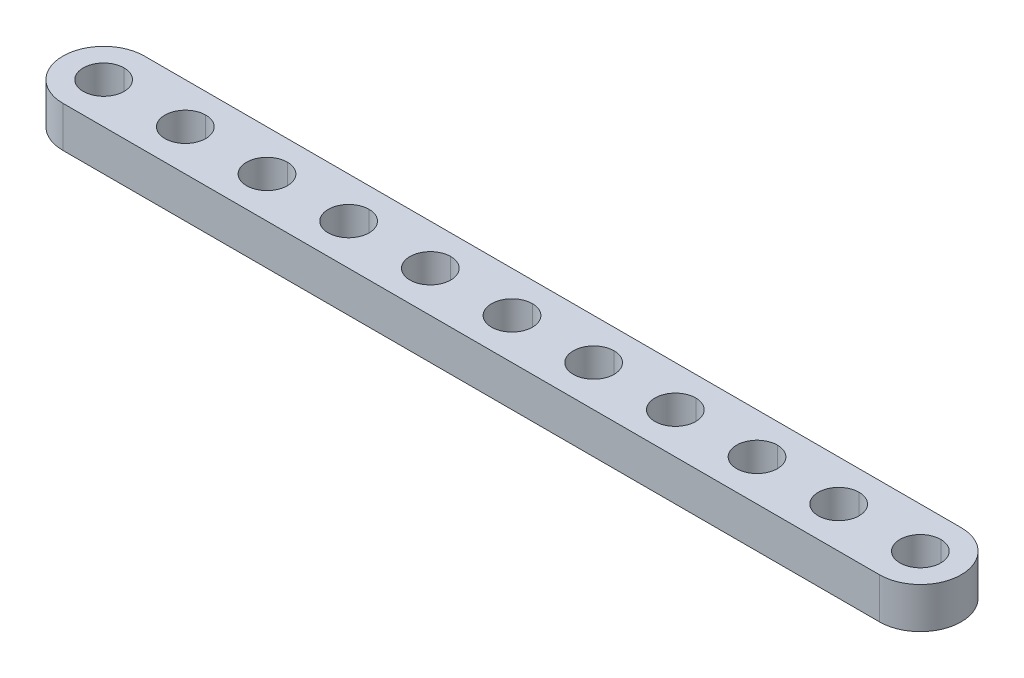
ISO-10303-21;
HEADER;
FILE_DESCRIPTION(('STEP AP214'),'2;1');
FILE_NAME('part.step','',(''),(''),'','','');
FILE_SCHEMA(('AUTOMOTIVE_DESIGN { 1 0 10303 214 1 1 1 1 }'));
ENDSEC;
DATA;
#1=APPLICATION_CONTEXT('core data for automotive mechanical design processes');
#2=APPLICATION_PROTOCOL_DEFINITION('international standard','automotive_design',2000,#1);
#3=PRODUCT_CONTEXT('',#1,'mechanical');
#4=PRODUCT('Part','Part','',(#3));
#5=PRODUCT_RELATED_PRODUCT_CATEGORY('part','',(#4));
#6=PRODUCT_DEFINITION_FORMATION('','',#4);
#7=PRODUCT_DEFINITION_CONTEXT('part definition',#1,'design');
#8=PRODUCT_DEFINITION('design','',#6,#7);
#9=PRODUCT_DEFINITION_SHAPE('','',#8);
#10=(LENGTH_UNIT() NAMED_UNIT(*) SI_UNIT(.MILLI.,.METRE.));
#11=(NAMED_UNIT(*) PLANE_ANGLE_UNIT() SI_UNIT($,.RADIAN.));
#12=(NAMED_UNIT(*) SI_UNIT($,.STERADIAN.) SOLID_ANGLE_UNIT());
#13=UNCERTAINTY_MEASURE_WITH_UNIT(LENGTH_MEASURE(1.E-05),#10,'distance_accuracy_value','');
#14=(GEOMETRIC_REPRESENTATION_CONTEXT(3) GLOBAL_UNCERTAINTY_ASSIGNED_CONTEXT((#13)) GLOBAL_UNIT_ASSIGNED_CONTEXT((#10,
#11,#12)) REPRESENTATION_CONTEXT('',''));
#15=CARTESIAN_POINT('',(0.,0.,0.));
#16=DIRECTION('',(0.,0.,1.));
#17=DIRECTION('',(1.,0.,0.));
#18=AXIS2_PLACEMENT_3D('',#15,#16,#17);
#19=CARTESIAN_POINT('',(40.,4.,0.));
#20=DIRECTION('',(0.,1.,0.));
#21=DIRECTION('',(0.,0.,1.));
#22=AXIS2_PLACEMENT_3D('',#19,#20,#21);
#23=CYLINDRICAL_SURFACE('',#22,2.);
#24=DIRECTION('',(0.,1.,0.));
#25=VECTOR('',#24,1.);
#26=CARTESIAN_POINT('',(40.,4.,-2.));
#27=LINE('',#26,#25);
#28=CARTESIAN_POINT('',(40.,0.,-2.));
#29=VERTEX_POINT('',#28);
#30=CARTESIAN_POINT('',(40.,4.,-2.));
#31=VERTEX_POINT('',#30);
#32=EDGE_CURVE('E360',#29,#31,#27,.T.);
#33=ORIENTED_EDGE('',*,*,#32,.F.);
#34=CARTESIAN_POINT('',(40.,0.,0.));
#35=DIRECTION('',(0.,1.,0.));
#36=DIRECTION('',(0.,0.,1.));
#37=AXIS2_PLACEMENT_3D('',#34,#35,#36);
#38=CIRCLE('',#37,2.);
#39=CARTESIAN_POINT('',(40.,0.,2.));
#40=VERTEX_POINT('',#39);
#41=EDGE_CURVE('E359',#40,#29,#38,.T.);
#42=ORIENTED_EDGE('',*,*,#41,.F.);
#43=DIRECTION('',(0.,1.,0.));
#44=VECTOR('',#43,1.);
#45=CARTESIAN_POINT('',(40.,4.,2.));
#46=LINE('',#45,#44);
#47=CARTESIAN_POINT('',(40.,4.,2.));
#48=VERTEX_POINT('',#47);
#49=EDGE_CURVE('E346',#40,#48,#46,.T.);
#50=ORIENTED_EDGE('',*,*,#49,.T.);
#51=CARTESIAN_POINT('',(40.,4.,0.));
#52=DIRECTION('',(0.,1.,0.));
#53=DIRECTION('',(0.,0.,1.));
#54=AXIS2_PLACEMENT_3D('',#51,#52,#53);
#55=CIRCLE('',#54,2.);
#56=EDGE_CURVE('E382',#48,#31,#55,.T.);
#57=ORIENTED_EDGE('',*,*,#56,.T.);
#58=EDGE_LOOP('',(#33,#42,#50,#57));
#59=FACE_BOUND('',#58,.T.);
#60=ADVANCED_FACE('F15',(#59),#23,.F.);
#61=CARTESIAN_POINT('',(32.,4.,0.));
#62=DIRECTION('',(0.,1.,0.));
#63=DIRECTION('',(0.,0.,1.));
#64=AXIS2_PLACEMENT_3D('',#61,#62,#63);
#65=CYLINDRICAL_SURFACE('',#64,2.);
#66=DIRECTION('',(0.,1.,0.));
#67=VECTOR('',#66,1.);
#68=CARTESIAN_POINT('',(32.,4.,-2.));
#69=LINE('',#68,#67);
#70=CARTESIAN_POINT('',(32.,0.,-2.));
#71=VERTEX_POINT('',#70);
#72=CARTESIAN_POINT('',(32.,4.,-2.));
#73=VERTEX_POINT('',#72);
#74=EDGE_CURVE('E314',#71,#73,#69,.T.);
#75=ORIENTED_EDGE('',*,*,#74,.F.);
#76=CARTESIAN_POINT('',(32.,0.,0.));
#77=DIRECTION('',(0.,1.,0.));
#78=DIRECTION('',(0.,0.,1.));
#79=AXIS2_PLACEMENT_3D('',#76,#77,#78);
#80=CIRCLE('',#79,2.);
#81=CARTESIAN_POINT('',(32.,0.,2.));
#82=VERTEX_POINT('',#81);
#83=EDGE_CURVE('E355',#82,#71,#80,.T.);
#84=ORIENTED_EDGE('',*,*,#83,.F.);
#85=DIRECTION('',(0.,1.,0.));
#86=VECTOR('',#85,1.);
#87=CARTESIAN_POINT('',(32.,4.,2.));
#88=LINE('',#87,#86);
#89=CARTESIAN_POINT('',(32.,4.,2.));
#90=VERTEX_POINT('',#89);
#91=EDGE_CURVE('E395',#82,#90,#88,.T.);
#92=ORIENTED_EDGE('',*,*,#91,.T.);
#93=CARTESIAN_POINT('',(32.,4.,0.));
#94=DIRECTION('',(0.,1.,0.));
#95=DIRECTION('',(0.,0.,1.));
#96=AXIS2_PLACEMENT_3D('',#93,#94,#95);
#97=CIRCLE('',#96,2.);
#98=EDGE_CURVE('E451',#90,#73,#97,.T.);
#99=ORIENTED_EDGE('',*,*,#98,.T.);
#100=EDGE_LOOP('',(#75,#84,#92,#99));
#101=FACE_BOUND('',#100,.T.);
#102=ADVANCED_FACE('F569',(#101),#65,.F.);
#103=CARTESIAN_POINT('',(24.,4.,0.));
#104=DIRECTION('',(0.,1.,0.));
#105=DIRECTION('',(0.,0.,1.));
#106=AXIS2_PLACEMENT_3D('',#103,#104,#105);
#107=CYLINDRICAL_SURFACE('',#106,2.);
#108=DIRECTION('',(0.,1.,0.));
#109=VECTOR('',#108,1.);
#110=CARTESIAN_POINT('',(24.,4.,-2.));
#111=LINE('',#110,#109);
#112=CARTESIAN_POINT('',(24.,0.,-2.));
#113=VERTEX_POINT('',#112);
#114=CARTESIAN_POINT('',(24.,4.,-2.));
#115=VERTEX_POINT('',#114);
#116=EDGE_CURVE('E337',#113,#115,#111,.T.);
#117=ORIENTED_EDGE('',*,*,#116,.F.);
#118=CARTESIAN_POINT('',(24.,0.,0.));
#119=DIRECTION('',(0.,1.,0.));
#120=DIRECTION('',(0.,0.,1.));
#121=AXIS2_PLACEMENT_3D('',#118,#119,#120);
#122=CIRCLE('',#121,2.);
#123=CARTESIAN_POINT('',(24.,0.,2.));
#124=VERTEX_POINT('',#123);
#125=EDGE_CURVE('E358',#124,#113,#122,.T.);
#126=ORIENTED_EDGE('',*,*,#125,.F.);
#127=DIRECTION('',(0.,1.,0.));
#128=VECTOR('',#127,1.);
#129=CARTESIAN_POINT('',(24.,4.,2.));
#130=LINE('',#129,#128);
#131=CARTESIAN_POINT('',(24.,4.,2.));
#132=VERTEX_POINT('',#131);
#133=EDGE_CURVE('E406',#124,#132,#130,.T.);
#134=ORIENTED_EDGE('',*,*,#133,.T.);
#135=CARTESIAN_POINT('',(24.,4.,0.));
#136=DIRECTION('',(0.,1.,0.));
#137=DIRECTION('',(0.,0.,1.));
#138=AXIS2_PLACEMENT_3D('',#135,#136,#137);
#139=CIRCLE('',#138,2.);
#140=EDGE_CURVE('E411',#132,#115,#139,.T.);
#141=ORIENTED_EDGE('',*,*,#140,.T.);
#142=EDGE_LOOP('',(#117,#126,#134,#141));
#143=FACE_BOUND('',#142,.T.);
#144=ADVANCED_FACE('F574',(#143),#107,.F.);
#145=CARTESIAN_POINT('',(16.,4.,0.));
#146=DIRECTION('',(0.,1.,0.));
#147=DIRECTION('',(0.,0.,1.));
#148=AXIS2_PLACEMENT_3D('',#145,#146,#147);
#149=CYLINDRICAL_SURFACE('',#148,2.);
#150=DIRECTION('',(0.,1.,0.));
#151=VECTOR('',#150,1.);
#152=CARTESIAN_POINT('',(16.,4.,-2.));
#153=LINE('',#152,#151);
#154=CARTESIAN_POINT('',(16.,0.,-2.));
#155=VERTEX_POINT('',#154);
#156=CARTESIAN_POINT('',(16.,4.,-2.));
#157=VERTEX_POINT('',#156);
#158=EDGE_CURVE('E427',#155,#157,#153,.T.);
#159=ORIENTED_EDGE('',*,*,#158,.F.);
#160=CARTESIAN_POINT('',(16.,0.,0.));
#161=DIRECTION('',(0.,1.,0.));
#162=DIRECTION('',(0.,0.,1.));
#163=AXIS2_PLACEMENT_3D('',#160,#161,#162);
#164=CIRCLE('',#163,2.);
#165=CARTESIAN_POINT('',(16.,0.,2.));
#166=VERTEX_POINT('',#165);
#167=EDGE_CURVE('E448',#166,#155,#164,.T.);
#168=ORIENTED_EDGE('',*,*,#167,.F.);
#169=DIRECTION('',(0.,1.,0.));
#170=VECTOR('',#169,1.);
#171=CARTESIAN_POINT('',(16.,4.,2.));
#172=LINE('',#171,#170);
#173=CARTESIAN_POINT('',(16.,4.,2.));
#174=VERTEX_POINT('',#173);
#175=EDGE_CURVE('E388',#166,#174,#172,.T.);
#176=ORIENTED_EDGE('',*,*,#175,.T.);
#177=CARTESIAN_POINT('',(16.,4.,0.));
#178=DIRECTION('',(0.,1.,0.));
#179=DIRECTION('',(0.,0.,1.));
#180=AXIS2_PLACEMENT_3D('',#177,#178,#179);
#181=CIRCLE('',#180,2.);
#182=EDGE_CURVE('E407',#174,#157,#181,.T.);
#183=ORIENTED_EDGE('',*,*,#182,.T.);
#184=EDGE_LOOP('',(#159,#168,#176,#183));
#185=FACE_BOUND('',#184,.T.);
#186=ADVANCED_FACE('F621',(#185),#149,.F.);
#187=CARTESIAN_POINT('',(8.,4.,0.));
#188=DIRECTION('',(0.,1.,0.));
#189=DIRECTION('',(0.,0.,1.));
#190=AXIS2_PLACEMENT_3D('',#187,#188,#189);
#191=CYLINDRICAL_SURFACE('',#190,2.);
#192=DIRECTION('',(0.,1.,0.));
#193=VECTOR('',#192,1.);
#194=CARTESIAN_POINT('',(8.,4.,-2.));
#195=LINE('',#194,#193);
#196=CARTESIAN_POINT('',(8.,0.,-2.));
#197=VERTEX_POINT('',#196);
#198=CARTESIAN_POINT('',(8.,4.,-2.));
#199=VERTEX_POINT('',#198);
#200=EDGE_CURVE('E325',#197,#199,#195,.T.);
#201=ORIENTED_EDGE('',*,*,#200,.F.);
#202=CARTESIAN_POINT('',(8.,0.,0.));
#203=DIRECTION('',(0.,1.,0.));
#204=DIRECTION('',(0.,0.,1.));
#205=AXIS2_PLACEMENT_3D('',#202,#203,#204);
#206=CIRCLE('',#205,2.);
#207=CARTESIAN_POINT('',(8.,0.,2.));
#208=VERTEX_POINT('',#207);
#209=EDGE_CURVE('E426',#208,#197,#206,.T.);
#210=ORIENTED_EDGE('',*,*,#209,.F.);
#211=DIRECTION('',(0.,1.,0.));
#212=VECTOR('',#211,1.);
#213=CARTESIAN_POINT('',(8.,4.,2.));
#214=LINE('',#213,#212);
#215=CARTESIAN_POINT('',(8.,4.,2.));
#216=VERTEX_POINT('',#215);
#217=EDGE_CURVE('E324',#208,#216,#214,.T.);
#218=ORIENTED_EDGE('',*,*,#217,.T.);
#219=CARTESIAN_POINT('',(8.,4.,0.));
#220=DIRECTION('',(0.,1.,0.));
#221=DIRECTION('',(0.,0.,1.));
#222=AXIS2_PLACEMENT_3D('',#219,#220,#221);
#223=CIRCLE('',#222,2.);
#224=EDGE_CURVE('E410',#216,#199,#223,.T.);
#225=ORIENTED_EDGE('',*,*,#224,.T.);
#226=EDGE_LOOP('',(#201,#210,#218,#225));
#227=FACE_BOUND('',#226,.T.);
#228=ADVANCED_FACE('F616',(#227),#191,.F.);
#229=CARTESIAN_POINT('',(0.,4.,0.));
#230=DIRECTION('',(0.,1.,0.));
#231=DIRECTION('',(0.,0.,1.));
#232=AXIS2_PLACEMENT_3D('',#229,#230,#231);
#233=CYLINDRICAL_SURFACE('',#232,2.);
#234=DIRECTION('',(0.,1.,0.));
#235=VECTOR('',#234,1.);
#236=CARTESIAN_POINT('',(0.,4.,-2.));
#237=LINE('',#236,#235);
#238=CARTESIAN_POINT('',(0.,0.,-2.));
#239=VERTEX_POINT('',#238);
#240=CARTESIAN_POINT('',(0.,4.,-2.));
#241=VERTEX_POINT('',#240);
#242=EDGE_CURVE('E331',#239,#241,#237,.T.);
#243=ORIENTED_EDGE('',*,*,#242,.F.);
#244=CARTESIAN_POINT('',(0.,0.,0.));
#245=DIRECTION('',(0.,1.,0.));
#246=DIRECTION('',(0.,0.,1.));
#247=AXIS2_PLACEMENT_3D('',#244,#245,#246);
#248=CIRCLE('',#247,2.);
#249=CARTESIAN_POINT('',(0.,0.,2.));
#250=VERTEX_POINT('',#249);
#251=EDGE_CURVE('E307',#250,#239,#248,.T.);
#252=ORIENTED_EDGE('',*,*,#251,.F.);
#253=DIRECTION('',(0.,1.,0.));
#254=VECTOR('',#253,1.);
#255=CARTESIAN_POINT('',(0.,4.,2.));
#256=LINE('',#255,#254);
#257=CARTESIAN_POINT('',(0.,4.,2.));
#258=VERTEX_POINT('',#257);
#259=EDGE_CURVE('E330',#250,#258,#256,.T.);
#260=ORIENTED_EDGE('',*,*,#259,.T.);
#261=CARTESIAN_POINT('',(0.,4.,0.));
#262=DIRECTION('',(0.,1.,0.));
#263=DIRECTION('',(0.,0.,1.));
#264=AXIS2_PLACEMENT_3D('',#261,#262,#263);
#265=CIRCLE('',#264,2.);
#266=EDGE_CURVE('E304',#258,#241,#265,.T.);
#267=ORIENTED_EDGE('',*,*,#266,.T.);
#268=EDGE_LOOP('',(#243,#252,#260,#267));
#269=FACE_BOUND('',#268,.T.);
#270=ADVANCED_FACE('F614',(#269),#233,.F.);
#271=CARTESIAN_POINT('',(-8.,4.,0.));
#272=DIRECTION('',(0.,1.,0.));
#273=DIRECTION('',(0.,0.,1.));
#274=AXIS2_PLACEMENT_3D('',#271,#272,#273);
#275=CYLINDRICAL_SURFACE('',#274,2.);
#276=DIRECTION('',(0.,1.,0.));
#277=VECTOR('',#276,1.);
#278=CARTESIAN_POINT('',(-8.,4.,-2.));
#279=LINE('',#278,#277);
#280=CARTESIAN_POINT('',(-8.,0.,-2.));
#281=VERTEX_POINT('',#280);
#282=CARTESIAN_POINT('',(-8.,4.,-2.));
#283=VERTEX_POINT('',#282);
#284=EDGE_CURVE('E420',#281,#283,#279,.T.);
#285=ORIENTED_EDGE('',*,*,#284,.F.);
#286=CARTESIAN_POINT('',(-8.,0.,0.));
#287=DIRECTION('',(0.,1.,0.));
#288=DIRECTION('',(0.,0.,1.));
#289=AXIS2_PLACEMENT_3D('',#286,#287,#288);
#290=CIRCLE('',#289,2.);
#291=CARTESIAN_POINT('',(-8.,0.,2.));
#292=VERTEX_POINT('',#291);
#293=EDGE_CURVE('E89',#292,#281,#290,.T.);
#294=ORIENTED_EDGE('',*,*,#293,.F.);
#295=DIRECTION('',(0.,1.,0.));
#296=VECTOR('',#295,1.);
#297=CARTESIAN_POINT('',(-8.,4.,2.));
#298=LINE('',#297,#296);
#299=CARTESIAN_POINT('',(-8.,4.,2.));
#300=VERTEX_POINT('',#299);
#301=EDGE_CURVE('E289',#292,#300,#298,.T.);
#302=ORIENTED_EDGE('',*,*,#301,.T.);
#303=CARTESIAN_POINT('',(-8.,4.,0.));
#304=DIRECTION('',(0.,1.,0.));
#305=DIRECTION('',(0.,0.,1.));
#306=AXIS2_PLACEMENT_3D('',#303,#304,#305);
#307=CIRCLE('',#306,2.);
#308=EDGE_CURVE('E300',#300,#283,#307,.T.);
#309=ORIENTED_EDGE('',*,*,#308,.T.);
#310=EDGE_LOOP('',(#285,#294,#302,#309));
#311=FACE_BOUND('',#310,.T.);
#312=ADVANCED_FACE('F611',(#311),#275,.F.);
#313=CARTESIAN_POINT('',(-16.,4.,0.));
#314=DIRECTION('',(0.,1.,0.));
#315=DIRECTION('',(0.,0.,1.));
#316=AXIS2_PLACEMENT_3D('',#313,#314,#315);
#317=CYLINDRICAL_SURFACE('',#316,2.);
#318=DIRECTION('',(0.,1.,0.));
#319=VECTOR('',#318,1.);
#320=CARTESIAN_POINT('',(-16.,4.,-2.));
#321=LINE('',#320,#319);
#322=CARTESIAN_POINT('',(-16.,0.,-2.));
#323=VERTEX_POINT('',#322);
#324=CARTESIAN_POINT('',(-16.,4.,-2.));
#325=VERTEX_POINT('',#324);
#326=EDGE_CURVE('E347',#323,#325,#321,.T.);
#327=ORIENTED_EDGE('',*,*,#326,.F.);
#328=CARTESIAN_POINT('',(-16.,0.,0.));
#329=DIRECTION('',(0.,1.,0.));
#330=DIRECTION('',(0.,0.,1.));
#331=AXIS2_PLACEMENT_3D('',#328,#329,#330);
#332=CIRCLE('',#331,2.);
#333=CARTESIAN_POINT('',(-16.,0.,2.));
#334=VERTEX_POINT('',#333);
#335=EDGE_CURVE('E263',#334,#323,#332,.T.);
#336=ORIENTED_EDGE('',*,*,#335,.F.);
#337=DIRECTION('',(0.,1.,0.));
#338=VECTOR('',#337,1.);
#339=CARTESIAN_POINT('',(-16.,4.,2.));
#340=LINE('',#339,#338);
#341=CARTESIAN_POINT('',(-16.,4.,2.));
#342=VERTEX_POINT('',#341);
#343=EDGE_CURVE('E275',#334,#342,#340,.T.);
#344=ORIENTED_EDGE('',*,*,#343,.T.);
#345=CARTESIAN_POINT('',(-16.,4.,0.));
#346=DIRECTION('',(0.,1.,0.));
#347=DIRECTION('',(0.,0.,1.));
#348=AXIS2_PLACEMENT_3D('',#345,#346,#347);
#349=CIRCLE('',#348,2.);
#350=EDGE_CURVE('E303',#342,#325,#349,.T.);
#351=ORIENTED_EDGE('',*,*,#350,.T.);
#352=EDGE_LOOP('',(#327,#336,#344,#351));
#353=FACE_BOUND('',#352,.T.);
#354=ADVANCED_FACE('F613',(#353),#317,.F.);
#355=CARTESIAN_POINT('',(-24.,4.,0.));
#356=DIRECTION('',(0.,1.,0.));
#357=DIRECTION('',(0.,0.,1.));
#358=AXIS2_PLACEMENT_3D('',#355,#356,#357);
#359=CYLINDRICAL_SURFACE('',#358,2.);
#360=DIRECTION('',(0.,1.,0.));
#361=VECTOR('',#360,1.);
#362=CARTESIAN_POINT('',(-24.,4.,-2.));
#363=LINE('',#362,#361);
#364=CARTESIAN_POINT('',(-24.,0.,-2.));
#365=VERTEX_POINT('',#364);
#366=CARTESIAN_POINT('',(-24.,4.,-2.));
#367=VERTEX_POINT('',#366);
#368=EDGE_CURVE('E258',#365,#367,#363,.T.);
#369=ORIENTED_EDGE('',*,*,#368,.F.);
#370=CARTESIAN_POINT('',(-24.,0.,0.));
#371=DIRECTION('',(0.,1.,0.));
#372=DIRECTION('',(0.,0.,1.));
#373=AXIS2_PLACEMENT_3D('',#370,#371,#372);
#374=CIRCLE('',#373,2.);
#375=CARTESIAN_POINT('',(-24.,0.,2.));
#376=VERTEX_POINT('',#375);
#377=EDGE_CURVE('E18',#376,#365,#374,.T.);
#378=ORIENTED_EDGE('',*,*,#377,.F.);
#379=DIRECTION('',(0.,1.,0.));
#380=VECTOR('',#379,1.);
#381=CARTESIAN_POINT('',(-24.,4.,2.));
#382=LINE('',#381,#380);
#383=CARTESIAN_POINT('',(-24.,4.,2.));
#384=VERTEX_POINT('',#383);
#385=EDGE_CURVE('E255',#376,#384,#382,.T.);
#386=ORIENTED_EDGE('',*,*,#385,.T.);
#387=CARTESIAN_POINT('',(-24.,4.,0.));
#388=DIRECTION('',(0.,1.,0.));
#389=DIRECTION('',(0.,0.,1.));
#390=AXIS2_PLACEMENT_3D('',#387,#388,#389);
#391=CIRCLE('',#390,2.);
#392=EDGE_CURVE('E336',#384,#367,#391,.T.);
#393=ORIENTED_EDGE('',*,*,#392,.T.);
#394=EDGE_LOOP('',(#369,#378,#386,#393));
#395=FACE_BOUND('',#394,.T.);
#396=ADVANCED_FACE('F254',(#395),#359,.F.);
#397=CARTESIAN_POINT('',(-32.,4.,0.));
#398=DIRECTION('',(0.,1.,0.));
#399=DIRECTION('',(0.,0.,1.));
#400=AXIS2_PLACEMENT_3D('',#397,#398,#399);
#401=CYLINDRICAL_SURFACE('',#400,2.);
#402=DIRECTION('',(0.,1.,0.));
#403=VECTOR('',#402,1.);
#404=CARTESIAN_POINT('',(-32.,4.,-2.));
#405=LINE('',#404,#403);
#406=CARTESIAN_POINT('',(-32.,0.,-2.));
#407=VERTEX_POINT('',#406);
#408=CARTESIAN_POINT('',(-32.,4.,-2.));
#409=VERTEX_POINT('',#408);
#410=EDGE_CURVE('E433',#407,#409,#405,.T.);
#411=ORIENTED_EDGE('',*,*,#410,.F.);
#412=CARTESIAN_POINT('',(-32.,0.,0.));
#413=DIRECTION('',(0.,1.,0.));
#414=DIRECTION('',(0.,0.,1.));
#415=AXIS2_PLACEMENT_3D('',#412,#413,#414);
#416=CIRCLE('',#415,2.);
#417=CARTESIAN_POINT('',(-32.,0.,2.));
#418=VERTEX_POINT('',#417);
#419=EDGE_CURVE('E25',#418,#407,#416,.T.);
#420=ORIENTED_EDGE('',*,*,#419,.F.);
#421=DIRECTION('',(0.,1.,0.));
#422=VECTOR('',#421,1.);
#423=CARTESIAN_POINT('',(-32.,4.,2.));
#424=LINE('',#423,#422);
#425=CARTESIAN_POINT('',(-32.,4.,2.));
#426=VERTEX_POINT('',#425);
#427=EDGE_CURVE('E294',#418,#426,#424,.T.);
#428=ORIENTED_EDGE('',*,*,#427,.T.);
#429=CARTESIAN_POINT('',(-32.,4.,0.));
#430=DIRECTION('',(0.,1.,0.));
#431=DIRECTION('',(0.,0.,1.));
#432=AXIS2_PLACEMENT_3D('',#429,#430,#431);
#433=CIRCLE('',#432,2.);
#434=EDGE_CURVE('E332',#426,#409,#433,.T.);
#435=ORIENTED_EDGE('',*,*,#434,.T.);
#436=EDGE_LOOP('',(#411,#420,#428,#435));
#437=FACE_BOUND('',#436,.T.);
#438=ADVANCED_FACE('F550',(#437),#401,.F.);
#439=CARTESIAN_POINT('',(-40.,4.,0.));
#440=DIRECTION('',(0.,1.,0.));
#441=DIRECTION('',(0.,0.,1.));
#442=AXIS2_PLACEMENT_3D('',#439,#440,#441);
#443=CYLINDRICAL_SURFACE('',#442,2.);
#444=DIRECTION('',(0.,1.,0.));
#445=VECTOR('',#444,1.);
#446=CARTESIAN_POINT('',(-40.,4.,-2.));
#447=LINE('',#446,#445);
#448=CARTESIAN_POINT('',(-40.,0.,-2.));
#449=VERTEX_POINT('',#448);
#450=CARTESIAN_POINT('',(-40.,4.,-2.));
#451=VERTEX_POINT('',#450);
#452=EDGE_CURVE('E440',#449,#451,#447,.T.);
#453=ORIENTED_EDGE('',*,*,#452,.F.);
#454=CARTESIAN_POINT('',(-40.,0.,0.));
#455=DIRECTION('',(0.,1.,0.));
#456=DIRECTION('',(0.,0.,1.));
#457=AXIS2_PLACEMENT_3D('',#454,#455,#456);
#458=CIRCLE('',#457,2.);
#459=CARTESIAN_POINT('',(-40.,0.,2.));
#460=VERTEX_POINT('',#459);
#461=EDGE_CURVE('E10',#460,#449,#458,.T.);
#462=ORIENTED_EDGE('',*,*,#461,.F.);
#463=DIRECTION('',(0.,1.,0.));
#464=VECTOR('',#463,1.);
#465=CARTESIAN_POINT('',(-40.,4.,2.));
#466=LINE('',#465,#464);
#467=CARTESIAN_POINT('',(-40.,4.,2.));
#468=VERTEX_POINT('',#467);
#469=EDGE_CURVE('E370',#460,#468,#466,.T.);
#470=ORIENTED_EDGE('',*,*,#469,.T.);
#471=CARTESIAN_POINT('',(-40.,4.,0.));
#472=DIRECTION('',(0.,1.,0.));
#473=DIRECTION('',(0.,0.,1.));
#474=AXIS2_PLACEMENT_3D('',#471,#472,#473);
#475=CIRCLE('',#474,2.);
#476=EDGE_CURVE('E335',#468,#451,#475,.T.);
#477=ORIENTED_EDGE('',*,*,#476,.T.);
#478=EDGE_LOOP('',(#453,#462,#470,#477));
#479=FACE_BOUND('',#478,.T.);
#480=ADVANCED_FACE('F553',(#479),#443,.F.);
#481=CARTESIAN_POINT('',(-40.,0.,0.));
#482=DIRECTION('',(0.,1.,0.));
#483=DIRECTION('',(1.,0.,0.));
#484=AXIS2_PLACEMENT_3D('',#481,#482,#483);
#485=PLANE('',#484);
#486=ORIENTED_EDGE('',*,*,#461,.T.);
#487=CARTESIAN_POINT('',(-40.,0.,0.));
#488=DIRECTION('',(0.,1.,0.));
#489=DIRECTION('',(0.,0.,1.));
#490=AXIS2_PLACEMENT_3D('',#487,#488,#489);
#491=CIRCLE('',#490,2.);
#492=EDGE_CURVE('E298',#449,#460,#491,.T.);
#493=ORIENTED_EDGE('',*,*,#492,.T.);
#494=EDGE_LOOP('',(#486,#493));
#495=FACE_BOUND('',#494,.T.);
#496=ORIENTED_EDGE('',*,*,#419,.T.);
#497=CARTESIAN_POINT('',(-32.,0.,0.));
#498=DIRECTION('',(0.,1.,0.));
#499=DIRECTION('',(0.,0.,1.));
#500=AXIS2_PLACEMENT_3D('',#497,#498,#499);
#501=CIRCLE('',#500,2.);
#502=EDGE_CURVE('E270',#407,#418,#501,.T.);
#503=ORIENTED_EDGE('',*,*,#502,.T.);
#504=EDGE_LOOP('',(#496,#503));
#505=FACE_BOUND('',#504,.T.);
#506=ORIENTED_EDGE('',*,*,#377,.T.);
#507=CARTESIAN_POINT('',(-24.,0.,0.));
#508=DIRECTION('',(0.,1.,0.));
#509=DIRECTION('',(0.,0.,1.));
#510=AXIS2_PLACEMENT_3D('',#507,#508,#509);
#511=CIRCLE('',#510,2.);
#512=EDGE_CURVE('E266',#365,#376,#511,.T.);
#513=ORIENTED_EDGE('',*,*,#512,.T.);
#514=EDGE_LOOP('',(#506,#513));
#515=FACE_BOUND('',#514,.T.);
#516=ORIENTED_EDGE('',*,*,#335,.T.);
#517=CARTESIAN_POINT('',(-16.,0.,0.));
#518=DIRECTION('',(0.,1.,0.));
#519=DIRECTION('',(0.,0.,1.));
#520=AXIS2_PLACEMENT_3D('',#517,#518,#519);
#521=CIRCLE('',#520,2.);
#522=EDGE_CURVE('E351',#323,#334,#521,.T.);
#523=ORIENTED_EDGE('',*,*,#522,.T.);
#524=EDGE_LOOP('',(#516,#523));
#525=FACE_BOUND('',#524,.T.);
#526=ORIENTED_EDGE('',*,*,#293,.T.);
#527=CARTESIAN_POINT('',(-8.,0.,0.));
#528=DIRECTION('',(0.,1.,0.));
#529=DIRECTION('',(0.,0.,1.));
#530=AXIS2_PLACEMENT_3D('',#527,#528,#529);
#531=CIRCLE('',#530,2.);
#532=EDGE_CURVE('E402',#281,#292,#531,.T.);
#533=ORIENTED_EDGE('',*,*,#532,.T.);
#534=EDGE_LOOP('',(#526,#533));
#535=FACE_BOUND('',#534,.T.);
#536=ORIENTED_EDGE('',*,*,#251,.T.);
#537=CARTESIAN_POINT('',(0.,0.,0.));
#538=DIRECTION('',(0.,1.,0.));
#539=DIRECTION('',(0.,0.,1.));
#540=AXIS2_PLACEMENT_3D('',#537,#538,#539);
#541=CIRCLE('',#540,2.);
#542=EDGE_CURVE('E415',#239,#250,#541,.T.);
#543=ORIENTED_EDGE('',*,*,#542,.T.);
#544=EDGE_LOOP('',(#536,#543));
#545=FACE_BOUND('',#544,.T.);
#546=ORIENTED_EDGE('',*,*,#209,.T.);
#547=CARTESIAN_POINT('',(8.,0.,0.));
#548=DIRECTION('',(0.,1.,0.));
#549=DIRECTION('',(0.,0.,1.));
#550=AXIS2_PLACEMENT_3D('',#547,#548,#549);
#551=CIRCLE('',#550,2.);
#552=EDGE_CURVE('E369',#197,#208,#551,.T.);
#553=ORIENTED_EDGE('',*,*,#552,.T.);
#554=EDGE_LOOP('',(#546,#553));
#555=FACE_BOUND('',#554,.T.);
#556=ORIENTED_EDGE('',*,*,#167,.T.);
#557=CARTESIAN_POINT('',(16.,0.,0.));
#558=DIRECTION('',(0.,1.,0.));
#559=DIRECTION('',(0.,0.,1.));
#560=AXIS2_PLACEMENT_3D('',#557,#558,#559);
#561=CIRCLE('',#560,2.);
#562=EDGE_CURVE('E432',#155,#166,#561,.T.);
#563=ORIENTED_EDGE('',*,*,#562,.T.);
#564=EDGE_LOOP('',(#556,#563));
#565=FACE_BOUND('',#564,.T.);
#566=ORIENTED_EDGE('',*,*,#125,.T.);
#567=CARTESIAN_POINT('',(24.,0.,0.));
#568=DIRECTION('',(0.,1.,0.));
#569=DIRECTION('',(0.,0.,1.));
#570=AXIS2_PLACEMENT_3D('',#567,#568,#569);
#571=CIRCLE('',#570,2.);
#572=EDGE_CURVE('E342',#113,#124,#571,.T.);
#573=ORIENTED_EDGE('',*,*,#572,.T.);
#574=EDGE_LOOP('',(#566,#573));
#575=FACE_BOUND('',#574,.T.);
#576=ORIENTED_EDGE('',*,*,#83,.T.);
#577=CARTESIAN_POINT('',(32.,0.,0.));
#578=DIRECTION('',(0.,1.,0.));
#579=DIRECTION('',(0.,0.,1.));
#580=AXIS2_PLACEMENT_3D('',#577,#578,#579);
#581=CIRCLE('',#580,2.);
#582=EDGE_CURVE('E318',#71,#82,#581,.T.);
#583=ORIENTED_EDGE('',*,*,#582,.T.);
#584=EDGE_LOOP('',(#576,#583));
#585=FACE_BOUND('',#584,.T.);
#586=ORIENTED_EDGE('',*,*,#41,.T.);
#587=CARTESIAN_POINT('',(40.,0.,0.));
#588=DIRECTION('',(0.,1.,0.));
#589=DIRECTION('',(0.,0.,1.));
#590=AXIS2_PLACEMENT_3D('',#587,#588,#589);
#591=CIRCLE('',#590,2.);
#592=EDGE_CURVE('E365',#29,#40,#591,.T.);
#593=ORIENTED_EDGE('',*,*,#592,.T.);
#594=EDGE_LOOP('',(#586,#593));
#595=FACE_BOUND('',#594,.T.);
#596=CARTESIAN_POINT('',(-40.,0.,0.));
#597=DIRECTION('',(0.,1.,0.));
#598=DIRECTION('',(0.,0.,1.));
#599=AXIS2_PLACEMENT_3D('',#596,#597,#598);
#600=CIRCLE('',#599,4.);
#601=CARTESIAN_POINT('',(-40.,0.,-4.));
#602=VERTEX_POINT('',#601);
#603=CARTESIAN_POINT('',(-40.,0.,4.));
#604=VERTEX_POINT('',#603);
#605=EDGE_CURVE('E374',#602,#604,#600,.T.);
#606=ORIENTED_EDGE('',*,*,#605,.F.);
#607=DIRECTION('',(-1.,0.,0.));
#608=VECTOR('',#607,1.);
#609=CARTESIAN_POINT('',(-40.,0.,-4.));
#610=LINE('',#609,#608);
#611=CARTESIAN_POINT('',(40.,0.,-4.));
#612=VERTEX_POINT('',#611);
#613=EDGE_CURVE('E291',#612,#602,#610,.T.);
#614=ORIENTED_EDGE('',*,*,#613,.F.);
#615=CARTESIAN_POINT('',(40.,0.,0.));
#616=DIRECTION('',(0.,1.,0.));
#617=DIRECTION('',(0.,0.,1.));
#618=AXIS2_PLACEMENT_3D('',#615,#616,#617);
#619=CIRCLE('',#618,4.);
#620=CARTESIAN_POINT('',(40.,0.,4.));
#621=VERTEX_POINT('',#620);
#622=EDGE_CURVE('E393',#621,#612,#619,.T.);
#623=ORIENTED_EDGE('',*,*,#622,.F.);
#624=DIRECTION('',(1.,0.,0.));
#625=VECTOR('',#624,1.);
#626=CARTESIAN_POINT('',(-40.,0.,4.));
#627=LINE('',#626,#625);
#628=EDGE_CURVE('E312',#604,#621,#627,.T.);
#629=ORIENTED_EDGE('',*,*,#628,.F.);
#630=EDGE_LOOP('',(#606,#614,#623,#629));
#631=FACE_BOUND('',#630,.T.);
#632=ADVANCED_FACE('F272',(#495,#505,#515,#525,#535,#545,#555,#565,#575,#585,#595,#631),#485,.F.);
#633=CARTESIAN_POINT('',(-40.,4.,0.));
#634=DIRECTION('',(0.,1.,0.));
#635=DIRECTION('',(1.,0.,0.));
#636=AXIS2_PLACEMENT_3D('',#633,#634,#635);
#637=PLANE('',#636);
#638=ORIENTED_EDGE('',*,*,#476,.F.);
#639=CARTESIAN_POINT('',(-40.,4.,0.));
#640=DIRECTION('',(0.,1.,0.));
#641=DIRECTION('',(0.,0.,1.));
#642=AXIS2_PLACEMENT_3D('',#639,#640,#641);
#643=CIRCLE('',#642,2.);
#644=EDGE_CURVE('E375',#451,#468,#643,.T.);
#645=ORIENTED_EDGE('',*,*,#644,.F.);
#646=EDGE_LOOP('',(#638,#645));
#647=FACE_BOUND('',#646,.T.);
#648=ORIENTED_EDGE('',*,*,#434,.F.);
#649=CARTESIAN_POINT('',(-32.,4.,0.));
#650=DIRECTION('',(0.,1.,0.));
#651=DIRECTION('',(0.,0.,1.));
#652=AXIS2_PLACEMENT_3D('',#649,#650,#651);
#653=CIRCLE('',#652,2.);
#654=EDGE_CURVE('E299',#409,#426,#653,.T.);
#655=ORIENTED_EDGE('',*,*,#654,.F.);
#656=EDGE_LOOP('',(#648,#655));
#657=FACE_BOUND('',#656,.T.);
#658=ORIENTED_EDGE('',*,*,#392,.F.);
#659=CARTESIAN_POINT('',(-24.,4.,0.));
#660=DIRECTION('',(0.,1.,0.));
#661=DIRECTION('',(0.,0.,1.));
#662=AXIS2_PLACEMENT_3D('',#659,#660,#661);
#663=CIRCLE('',#662,2.);
#664=EDGE_CURVE('E268',#367,#384,#663,.T.);
#665=ORIENTED_EDGE('',*,*,#664,.F.);
#666=EDGE_LOOP('',(#658,#665));
#667=FACE_BOUND('',#666,.T.);
#668=ORIENTED_EDGE('',*,*,#350,.F.);
#669=CARTESIAN_POINT('',(-16.,4.,0.));
#670=DIRECTION('',(0.,1.,0.));
#671=DIRECTION('',(0.,0.,1.));
#672=AXIS2_PLACEMENT_3D('',#669,#670,#671);
#673=CIRCLE('',#672,2.);
#674=EDGE_CURVE('E285',#325,#342,#673,.T.);
#675=ORIENTED_EDGE('',*,*,#674,.F.);
#676=EDGE_LOOP('',(#668,#675));
#677=FACE_BOUND('',#676,.T.);
#678=ORIENTED_EDGE('',*,*,#308,.F.);
#679=CARTESIAN_POINT('',(-8.,4.,0.));
#680=DIRECTION('',(0.,1.,0.));
#681=DIRECTION('',(0.,0.,1.));
#682=AXIS2_PLACEMENT_3D('',#679,#680,#681);
#683=CIRCLE('',#682,2.);
#684=EDGE_CURVE('E416',#283,#300,#683,.T.);
#685=ORIENTED_EDGE('',*,*,#684,.F.);
#686=EDGE_LOOP('',(#678,#685));
#687=FACE_BOUND('',#686,.T.);
#688=ORIENTED_EDGE('',*,*,#266,.F.);
#689=CARTESIAN_POINT('',(0.,4.,0.));
#690=DIRECTION('',(0.,1.,0.));
#691=DIRECTION('',(0.,0.,1.));
#692=AXIS2_PLACEMENT_3D('',#689,#690,#691);
#693=CIRCLE('',#692,2.);
#694=EDGE_CURVE('E326',#241,#258,#693,.T.);
#695=ORIENTED_EDGE('',*,*,#694,.F.);
#696=EDGE_LOOP('',(#688,#695));
#697=FACE_BOUND('',#696,.T.);
#698=ORIENTED_EDGE('',*,*,#224,.F.);
#699=CARTESIAN_POINT('',(8.,4.,0.));
#700=DIRECTION('',(0.,1.,0.));
#701=DIRECTION('',(0.,0.,1.));
#702=AXIS2_PLACEMENT_3D('',#699,#700,#701);
#703=CIRCLE('',#702,2.);
#704=EDGE_CURVE('E320',#199,#216,#703,.T.);
#705=ORIENTED_EDGE('',*,*,#704,.F.);
#706=EDGE_LOOP('',(#698,#705));
#707=FACE_BOUND('',#706,.T.);
#708=ORIENTED_EDGE('',*,*,#182,.F.);
#709=CARTESIAN_POINT('',(16.,4.,0.));
#710=DIRECTION('',(0.,1.,0.));
#711=DIRECTION('',(0.,0.,1.));
#712=AXIS2_PLACEMENT_3D('',#709,#710,#711);
#713=CIRCLE('',#712,2.);
#714=EDGE_CURVE('E431',#157,#174,#713,.T.);
#715=ORIENTED_EDGE('',*,*,#714,.F.);
#716=EDGE_LOOP('',(#708,#715));
#717=FACE_BOUND('',#716,.T.);
#718=ORIENTED_EDGE('',*,*,#140,.F.);
#719=CARTESIAN_POINT('',(24.,4.,0.));
#720=DIRECTION('',(0.,1.,0.));
#721=DIRECTION('',(0.,0.,1.));
#722=AXIS2_PLACEMENT_3D('',#719,#720,#721);
#723=CIRCLE('',#722,2.);
#724=EDGE_CURVE('E341',#115,#132,#723,.T.);
#725=ORIENTED_EDGE('',*,*,#724,.F.);
#726=EDGE_LOOP('',(#718,#725));
#727=FACE_BOUND('',#726,.T.);
#728=ORIENTED_EDGE('',*,*,#98,.F.);
#729=CARTESIAN_POINT('',(32.,4.,0.));
#730=DIRECTION('',(0.,1.,0.));
#731=DIRECTION('',(0.,0.,1.));
#732=AXIS2_PLACEMENT_3D('',#729,#730,#731);
#733=CIRCLE('',#732,2.);
#734=EDGE_CURVE('E317',#73,#90,#733,.T.);
#735=ORIENTED_EDGE('',*,*,#734,.F.);
#736=EDGE_LOOP('',(#728,#735));
#737=FACE_BOUND('',#736,.T.);
#738=ORIENTED_EDGE('',*,*,#56,.F.);
#739=CARTESIAN_POINT('',(40.,4.,0.));
#740=DIRECTION('',(0.,1.,0.));
#741=DIRECTION('',(0.,0.,1.));
#742=AXIS2_PLACEMENT_3D('',#739,#740,#741);
#743=CIRCLE('',#742,2.);
#744=EDGE_CURVE('E364',#31,#48,#743,.T.);
#745=ORIENTED_EDGE('',*,*,#744,.F.);
#746=EDGE_LOOP('',(#738,#745));
#747=FACE_BOUND('',#746,.T.);
#748=CARTESIAN_POINT('',(-40.,4.,0.));
#749=DIRECTION('',(0.,1.,0.));
#750=DIRECTION('',(0.,0.,1.));
#751=AXIS2_PLACEMENT_3D('',#748,#749,#750);
#752=CIRCLE('',#751,4.);
#753=CARTESIAN_POINT('',(-40.,4.,-4.));
#754=VERTEX_POINT('',#753);
#755=CARTESIAN_POINT('',(-40.,4.,4.));
#756=VERTEX_POINT('',#755);
#757=EDGE_CURVE('E313',#754,#756,#752,.T.);
#758=ORIENTED_EDGE('',*,*,#757,.T.);
#759=DIRECTION('',(1.,0.,0.));
#760=VECTOR('',#759,1.);
#761=CARTESIAN_POINT('',(-40.,4.,4.));
#762=LINE('',#761,#760);
#763=CARTESIAN_POINT('',(40.,4.,4.));
#764=VERTEX_POINT('',#763);
#765=EDGE_CURVE('E389',#756,#764,#762,.T.);
#766=ORIENTED_EDGE('',*,*,#765,.T.);
#767=CARTESIAN_POINT('',(40.,4.,0.));
#768=DIRECTION('',(0.,1.,0.));
#769=DIRECTION('',(0.,0.,1.));
#770=AXIS2_PLACEMENT_3D('',#767,#768,#769);
#771=CIRCLE('',#770,4.);
#772=CARTESIAN_POINT('',(40.,4.,-4.));
#773=VERTEX_POINT('',#772);
#774=EDGE_CURVE('E293',#764,#773,#771,.T.);
#775=ORIENTED_EDGE('',*,*,#774,.T.);
#776=DIRECTION('',(-1.,0.,0.));
#777=VECTOR('',#776,1.);
#778=CARTESIAN_POINT('',(-40.,4.,-4.));
#779=LINE('',#778,#777);
#780=EDGE_CURVE('E40',#773,#754,#779,.T.);
#781=ORIENTED_EDGE('',*,*,#780,.T.);
#782=EDGE_LOOP('',(#758,#766,#775,#781));
#783=FACE_BOUND('',#782,.T.);
#784=ADVANCED_FACE('F547',(#647,#657,#667,#677,#687,#697,#707,#717,#727,#737,#747,#783),#637,.T.);
#785=CARTESIAN_POINT('',(-40.,4.,-4.));
#786=DIRECTION('',(0.,0.,1.));
#787=DIRECTION('',(1.,0.,0.));
#788=AXIS2_PLACEMENT_3D('',#785,#786,#787);
#789=PLANE('',#788);
#790=ORIENTED_EDGE('',*,*,#613,.T.);
#791=DIRECTION('',(0.,-1.,0.));
#792=VECTOR('',#791,1.);
#793=CARTESIAN_POINT('',(-40.,4.,-4.));
#794=LINE('',#793,#792);
#795=EDGE_CURVE('E308',#754,#602,#794,.T.);
#796=ORIENTED_EDGE('',*,*,#795,.F.);
#797=ORIENTED_EDGE('',*,*,#780,.F.);
#798=DIRECTION('',(0.,-1.,0.));
#799=VECTOR('',#798,1.);
#800=CARTESIAN_POINT('',(40.,4.,-4.));
#801=LINE('',#800,#799);
#802=EDGE_CURVE('E421',#773,#612,#801,.T.);
#803=ORIENTED_EDGE('',*,*,#802,.T.);
#804=EDGE_LOOP('',(#790,#796,#797,#803));
#805=FACE_BOUND('',#804,.T.);
#806=ADVANCED_FACE('F561',(#805),#789,.F.);
#807=CARTESIAN_POINT('',(40.,4.,0.));
#808=DIRECTION('',(0.,-1.,0.));
#809=DIRECTION('',(0.,0.,-1.));
#810=AXIS2_PLACEMENT_3D('',#807,#808,#809);
#811=CYLINDRICAL_SURFACE('',#810,4.);
#812=ORIENTED_EDGE('',*,*,#622,.T.);
#813=ORIENTED_EDGE('',*,*,#802,.F.);
#814=ORIENTED_EDGE('',*,*,#774,.F.);
#815=DIRECTION('',(0.,-1.,0.));
#816=VECTOR('',#815,1.);
#817=CARTESIAN_POINT('',(40.,4.,4.));
#818=LINE('',#817,#816);
#819=EDGE_CURVE('E394',#764,#621,#818,.T.);
#820=ORIENTED_EDGE('',*,*,#819,.T.);
#821=EDGE_LOOP('',(#812,#813,#814,#820));
#822=FACE_BOUND('',#821,.T.);
#823=ADVANCED_FACE('F593',(#822),#811,.T.);
#824=CARTESIAN_POINT('',(-40.,4.,4.));
#825=DIRECTION('',(0.,0.,-1.));
#826=DIRECTION('',(0.,-1.,0.));
#827=AXIS2_PLACEMENT_3D('',#824,#825,#826);
#828=PLANE('',#827);
#829=ORIENTED_EDGE('',*,*,#628,.T.);
#830=ORIENTED_EDGE('',*,*,#819,.F.);
#831=ORIENTED_EDGE('',*,*,#765,.F.);
#832=DIRECTION('',(0.,-1.,0.));
#833=VECTOR('',#832,1.);
#834=CARTESIAN_POINT('',(-40.,4.,4.));
#835=LINE('',#834,#833);
#836=EDGE_CURVE('E483',#756,#604,#835,.T.);
#837=ORIENTED_EDGE('',*,*,#836,.T.);
#838=EDGE_LOOP('',(#829,#830,#831,#837));
#839=FACE_BOUND('',#838,.T.);
#840=ADVANCED_FACE('F596',(#839),#828,.F.);
#841=CARTESIAN_POINT('',(-40.,4.,0.));
#842=DIRECTION('',(0.,-1.,0.));
#843=DIRECTION('',(0.,0.,-1.));
#844=AXIS2_PLACEMENT_3D('',#841,#842,#843);
#845=CYLINDRICAL_SURFACE('',#844,4.);
#846=ORIENTED_EDGE('',*,*,#605,.T.);
#847=ORIENTED_EDGE('',*,*,#836,.F.);
#848=ORIENTED_EDGE('',*,*,#757,.F.);
#849=ORIENTED_EDGE('',*,*,#795,.T.);
#850=EDGE_LOOP('',(#846,#847,#848,#849));
#851=FACE_BOUND('',#850,.T.);
#852=ADVANCED_FACE('F589',(#851),#845,.T.);
#853=CARTESIAN_POINT('',(-40.,4.,0.));
#854=DIRECTION('',(0.,1.,0.));
#855=DIRECTION('',(0.,0.,1.));
#856=AXIS2_PLACEMENT_3D('',#853,#854,#855);
#857=CYLINDRICAL_SURFACE('',#856,2.);
#858=ORIENTED_EDGE('',*,*,#492,.F.);
#859=ORIENTED_EDGE('',*,*,#452,.T.);
#860=ORIENTED_EDGE('',*,*,#644,.T.);
#861=ORIENTED_EDGE('',*,*,#469,.F.);
#862=EDGE_LOOP('',(#858,#859,#860,#861));
#863=FACE_BOUND('',#862,.T.);
#864=ADVANCED_FACE('F604',(#863),#857,.F.);
#865=CARTESIAN_POINT('',(-32.,4.,0.));
#866=DIRECTION('',(0.,1.,0.));
#867=DIRECTION('',(0.,0.,1.));
#868=AXIS2_PLACEMENT_3D('',#865,#866,#867);
#869=CYLINDRICAL_SURFACE('',#868,2.);
#870=ORIENTED_EDGE('',*,*,#502,.F.);
#871=ORIENTED_EDGE('',*,*,#410,.T.);
#872=ORIENTED_EDGE('',*,*,#654,.T.);
#873=ORIENTED_EDGE('',*,*,#427,.F.);
#874=EDGE_LOOP('',(#870,#871,#872,#873));
#875=FACE_BOUND('',#874,.T.);
#876=ADVANCED_FACE('F544',(#875),#869,.F.);
#877=CARTESIAN_POINT('',(-24.,4.,0.));
#878=DIRECTION('',(0.,1.,0.));
#879=DIRECTION('',(0.,0.,1.));
#880=AXIS2_PLACEMENT_3D('',#877,#878,#879);
#881=CYLINDRICAL_SURFACE('',#880,2.);
#882=ORIENTED_EDGE('',*,*,#512,.F.);
#883=ORIENTED_EDGE('',*,*,#368,.T.);
#884=ORIENTED_EDGE('',*,*,#664,.T.);
#885=ORIENTED_EDGE('',*,*,#385,.F.);
#886=EDGE_LOOP('',(#882,#883,#884,#885));
#887=FACE_BOUND('',#886,.T.);
#888=ADVANCED_FACE('F265',(#887),#881,.F.);
#889=CARTESIAN_POINT('',(-16.,4.,0.));
#890=DIRECTION('',(0.,1.,0.));
#891=DIRECTION('',(0.,0.,1.));
#892=AXIS2_PLACEMENT_3D('',#889,#890,#891);
#893=CYLINDRICAL_SURFACE('',#892,2.);
#894=ORIENTED_EDGE('',*,*,#522,.F.);
#895=ORIENTED_EDGE('',*,*,#326,.T.);
#896=ORIENTED_EDGE('',*,*,#674,.T.);
#897=ORIENTED_EDGE('',*,*,#343,.F.);
#898=EDGE_LOOP('',(#894,#895,#896,#897));
#899=FACE_BOUND('',#898,.T.);
#900=ADVANCED_FACE('F714',(#899),#893,.F.);
#901=CARTESIAN_POINT('',(-8.,4.,0.));
#902=DIRECTION('',(0.,1.,0.));
#903=DIRECTION('',(0.,0.,1.));
#904=AXIS2_PLACEMENT_3D('',#901,#902,#903);
#905=CYLINDRICAL_SURFACE('',#904,2.);
#906=ORIENTED_EDGE('',*,*,#532,.F.);
#907=ORIENTED_EDGE('',*,*,#284,.T.);
#908=ORIENTED_EDGE('',*,*,#684,.T.);
#909=ORIENTED_EDGE('',*,*,#301,.F.);
#910=EDGE_LOOP('',(#906,#907,#908,#909));
#911=FACE_BOUND('',#910,.T.);
#912=ADVANCED_FACE('F716',(#911),#905,.F.);
#913=CARTESIAN_POINT('',(0.,4.,0.));
#914=DIRECTION('',(0.,1.,0.));
#915=DIRECTION('',(0.,0.,1.));
#916=AXIS2_PLACEMENT_3D('',#913,#914,#915);
#917=CYLINDRICAL_SURFACE('',#916,2.);
#918=ORIENTED_EDGE('',*,*,#542,.F.);
#919=ORIENTED_EDGE('',*,*,#242,.T.);
#920=ORIENTED_EDGE('',*,*,#694,.T.);
#921=ORIENTED_EDGE('',*,*,#259,.F.);
#922=EDGE_LOOP('',(#918,#919,#920,#921));
#923=FACE_BOUND('',#922,.T.);
#924=ADVANCED_FACE('F628',(#923),#917,.F.);
#925=CARTESIAN_POINT('',(8.,4.,0.));
#926=DIRECTION('',(0.,1.,0.));
#927=DIRECTION('',(0.,0.,1.));
#928=AXIS2_PLACEMENT_3D('',#925,#926,#927);
#929=CYLINDRICAL_SURFACE('',#928,2.);
#930=ORIENTED_EDGE('',*,*,#552,.F.);
#931=ORIENTED_EDGE('',*,*,#200,.T.);
#932=ORIENTED_EDGE('',*,*,#704,.T.);
#933=ORIENTED_EDGE('',*,*,#217,.F.);
#934=EDGE_LOOP('',(#930,#931,#932,#933));
#935=FACE_BOUND('',#934,.T.);
#936=ADVANCED_FACE('F748',(#935),#929,.F.);
#937=CARTESIAN_POINT('',(16.,4.,0.));
#938=DIRECTION('',(0.,1.,0.));
#939=DIRECTION('',(0.,0.,1.));
#940=AXIS2_PLACEMENT_3D('',#937,#938,#939);
#941=CYLINDRICAL_SURFACE('',#940,2.);
#942=ORIENTED_EDGE('',*,*,#562,.F.);
#943=ORIENTED_EDGE('',*,*,#158,.T.);
#944=ORIENTED_EDGE('',*,*,#714,.T.);
#945=ORIENTED_EDGE('',*,*,#175,.F.);
#946=EDGE_LOOP('',(#942,#943,#944,#945));
#947=FACE_BOUND('',#946,.T.);
#948=ADVANCED_FACE('F742',(#947),#941,.F.);
#949=CARTESIAN_POINT('',(24.,4.,0.));
#950=DIRECTION('',(0.,1.,0.));
#951=DIRECTION('',(0.,0.,1.));
#952=AXIS2_PLACEMENT_3D('',#949,#950,#951);
#953=CYLINDRICAL_SURFACE('',#952,2.);
#954=ORIENTED_EDGE('',*,*,#572,.F.);
#955=ORIENTED_EDGE('',*,*,#116,.T.);
#956=ORIENTED_EDGE('',*,*,#724,.T.);
#957=ORIENTED_EDGE('',*,*,#133,.F.);
#958=EDGE_LOOP('',(#954,#955,#956,#957));
#959=FACE_BOUND('',#958,.T.);
#960=ADVANCED_FACE('F609',(#959),#953,.F.);
#961=CARTESIAN_POINT('',(32.,4.,0.));
#962=DIRECTION('',(0.,1.,0.));
#963=DIRECTION('',(0.,0.,1.));
#964=AXIS2_PLACEMENT_3D('',#961,#962,#963);
#965=CYLINDRICAL_SURFACE('',#964,2.);
#966=ORIENTED_EDGE('',*,*,#582,.F.);
#967=ORIENTED_EDGE('',*,*,#74,.T.);
#968=ORIENTED_EDGE('',*,*,#734,.T.);
#969=ORIENTED_EDGE('',*,*,#91,.F.);
#970=EDGE_LOOP('',(#966,#967,#968,#969));
#971=FACE_BOUND('',#970,.T.);
#972=ADVANCED_FACE('F642',(#971),#965,.F.);
#973=CARTESIAN_POINT('',(40.,4.,0.));
#974=DIRECTION('',(0.,1.,0.));
#975=DIRECTION('',(0.,0.,1.));
#976=AXIS2_PLACEMENT_3D('',#973,#974,#975);
#977=CYLINDRICAL_SURFACE('',#976,2.);
#978=ORIENTED_EDGE('',*,*,#592,.F.);
#979=ORIENTED_EDGE('',*,*,#32,.T.);
#980=ORIENTED_EDGE('',*,*,#744,.T.);
#981=ORIENTED_EDGE('',*,*,#49,.F.);
#982=EDGE_LOOP('',(#978,#979,#980,#981));
#983=FACE_BOUND('',#982,.T.);
#984=ADVANCED_FACE('F583',(#983),#977,.F.);
#985=CLOSED_SHELL('',(#60,#102,#144,#186,#228,#270,#312,#354,#396,#438,#480,#632,#784,#806,#823,
#840,#852,#864,#876,#888,#900,#912,#924,#936,#948,#960,#972,#984));
#986=MANIFOLD_SOLID_BREP('B1',#985);
#987=ADVANCED_BREP_SHAPE_REPRESENTATION('',(#18,#986),#14);
#988=SHAPE_DEFINITION_REPRESENTATION(#9,#987);
ENDSEC;
END-ISO-10303-21;
